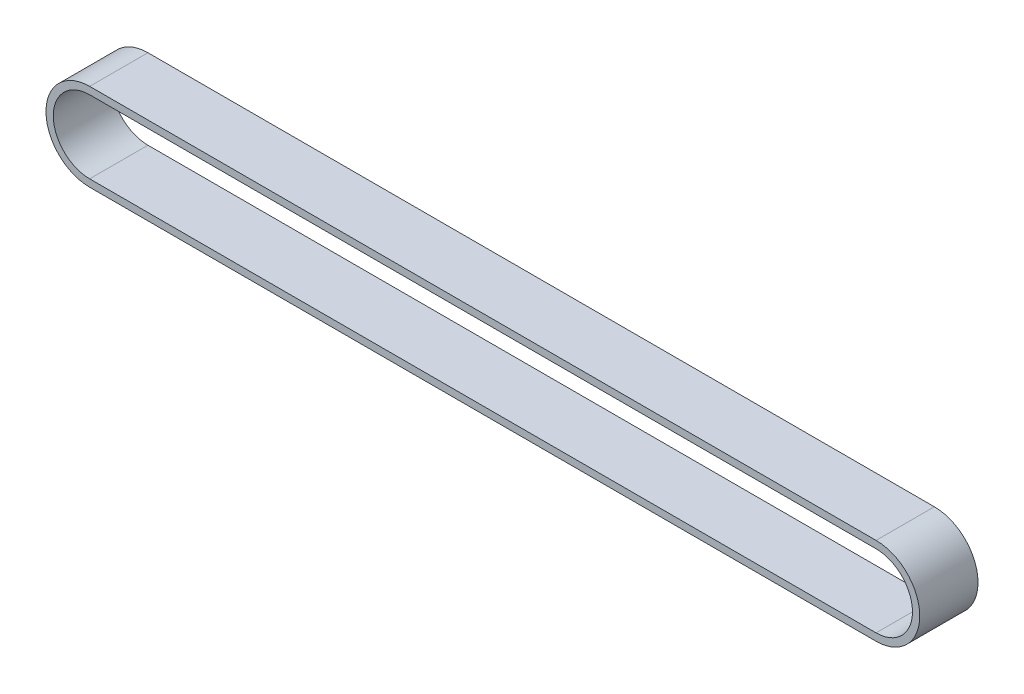
ISO-10303-21;
HEADER;
FILE_DESCRIPTION(('STEP AP214'),'2;1');
FILE_NAME('part.step','',(''),(''),'','','');
FILE_SCHEMA(('AUTOMOTIVE_DESIGN { 1 0 10303 214 1 1 1 1 }'));
ENDSEC;
DATA;
#1=APPLICATION_CONTEXT('core data for automotive mechanical design processes');
#2=APPLICATION_PROTOCOL_DEFINITION('international standard','automotive_design',2000,#1);
#3=PRODUCT_CONTEXT('',#1,'mechanical');
#4=PRODUCT('Part','Part','',(#3));
#5=PRODUCT_RELATED_PRODUCT_CATEGORY('part','',(#4));
#6=PRODUCT_DEFINITION_FORMATION('','',#4);
#7=PRODUCT_DEFINITION_CONTEXT('part definition',#1,'design');
#8=PRODUCT_DEFINITION('design','',#6,#7);
#9=PRODUCT_DEFINITION_SHAPE('','',#8);
#10=(LENGTH_UNIT() NAMED_UNIT(*) SI_UNIT(.MILLI.,.METRE.));
#11=(NAMED_UNIT(*) PLANE_ANGLE_UNIT() SI_UNIT($,.RADIAN.));
#12=(NAMED_UNIT(*) SI_UNIT($,.STERADIAN.) SOLID_ANGLE_UNIT());
#13=UNCERTAINTY_MEASURE_WITH_UNIT(LENGTH_MEASURE(1.E-05),#10,'distance_accuracy_value','');
#14=(GEOMETRIC_REPRESENTATION_CONTEXT(3) GLOBAL_UNCERTAINTY_ASSIGNED_CONTEXT((#13)) GLOBAL_UNIT_ASSIGNED_CONTEXT((#10,
#11,#12)) REPRESENTATION_CONTEXT('',''));
#15=CARTESIAN_POINT('',(0.,0.,0.));
#16=DIRECTION('',(0.,0.,1.));
#17=DIRECTION('',(1.,0.,0.));
#18=AXIS2_PLACEMENT_3D('',#15,#16,#17);
#19=CARTESIAN_POINT('',(-18.8262894297513,0.,8.));
#20=DIRECTION('',(0.,0.,1.));
#21=DIRECTION('',(1.,0.,0.));
#22=AXIS2_PLACEMENT_3D('',#19,#20,#21);
#23=PLANE('',#22);
#24=CARTESIAN_POINT('',(-18.8262894297513,0.,8.));
#25=DIRECTION('',(0.,0.,1.));
#26=DIRECTION('',(1.,0.,0.));
#27=AXIS2_PLACEMENT_3D('',#24,#25,#26);
#28=CIRCLE('',#27,6.);
#29=CARTESIAN_POINT('',(-18.8262894297513,6.,8.));
#30=VERTEX_POINT('',#29);
#31=CARTESIAN_POINT('',(-18.8262894297513,-6.,8.));
#32=VERTEX_POINT('',#31);
#33=EDGE_CURVE('E134',#30,#32,#28,.T.);
#34=ORIENTED_EDGE('',*,*,#33,.T.);
#35=DIRECTION('',(1.,0.,0.));
#36=VECTOR('',#35,1.);
#37=CARTESIAN_POINT('',(-18.8262894297513,-6.,8.));
#38=LINE('',#37,#36);
#39=CARTESIAN_POINT('',(89.1737105702487,-6.,8.));
#40=VERTEX_POINT('',#39);
#41=EDGE_CURVE('E137',#32,#40,#38,.T.);
#42=ORIENTED_EDGE('',*,*,#41,.T.);
#43=CARTESIAN_POINT('',(89.1737105702487,0.,8.));
#44=DIRECTION('',(0.,0.,1.));
#45=DIRECTION('',(1.,0.,0.));
#46=AXIS2_PLACEMENT_3D('',#43,#44,#45);
#47=CIRCLE('',#46,6.);
#48=CARTESIAN_POINT('',(89.1737105702487,6.,8.));
#49=VERTEX_POINT('',#48);
#50=EDGE_CURVE('E140',#40,#49,#47,.T.);
#51=ORIENTED_EDGE('',*,*,#50,.T.);
#52=DIRECTION('',(-1.,0.,0.));
#53=VECTOR('',#52,1.);
#54=CARTESIAN_POINT('',(-18.8262894297513,6.,8.));
#55=LINE('',#54,#53);
#56=EDGE_CURVE('E142',#49,#30,#55,.T.);
#57=ORIENTED_EDGE('',*,*,#56,.T.);
#58=EDGE_LOOP('',(#34,#42,#51,#57));
#59=FACE_BOUND('',#58,.T.);
#60=DIRECTION('',(1.,0.,0.));
#61=VECTOR('',#60,1.);
#62=CARTESIAN_POINT('',(-18.8262894297513,-5.,8.));
#63=LINE('',#62,#61);
#64=CARTESIAN_POINT('',(-18.8262894297513,-5.,8.));
#65=VERTEX_POINT('',#64);
#66=CARTESIAN_POINT('',(89.1737105702487,-5.,8.));
#67=VERTEX_POINT('',#66);
#68=EDGE_CURVE('E106',#65,#67,#63,.T.);
#69=ORIENTED_EDGE('',*,*,#68,.F.);
#70=CARTESIAN_POINT('',(-18.8262894297513,0.,8.));
#71=DIRECTION('',(0.,0.,1.));
#72=DIRECTION('',(1.,0.,0.));
#73=AXIS2_PLACEMENT_3D('',#70,#71,#72);
#74=CIRCLE('',#73,5.);
#75=CARTESIAN_POINT('',(-18.8262894297513,5.,8.));
#76=VERTEX_POINT('',#75);
#77=EDGE_CURVE('E98',#76,#65,#74,.T.);
#78=ORIENTED_EDGE('',*,*,#77,.F.);
#79=DIRECTION('',(-1.,0.,0.));
#80=VECTOR('',#79,1.);
#81=CARTESIAN_POINT('',(-18.8262894297513,5.,8.));
#82=LINE('',#81,#80);
#83=CARTESIAN_POINT('',(89.1737105702487,5.,8.));
#84=VERTEX_POINT('',#83);
#85=EDGE_CURVE('E120',#84,#76,#82,.T.);
#86=ORIENTED_EDGE('',*,*,#85,.F.);
#87=CARTESIAN_POINT('',(89.1737105702487,0.,8.));
#88=DIRECTION('',(0.,0.,1.));
#89=DIRECTION('',(1.,0.,0.));
#90=AXIS2_PLACEMENT_3D('',#87,#88,#89);
#91=CIRCLE('',#90,5.);
#92=EDGE_CURVE('E118',#67,#84,#91,.T.);
#93=ORIENTED_EDGE('',*,*,#92,.F.);
#94=EDGE_LOOP('',(#69,#78,#86,#93));
#95=FACE_BOUND('',#94,.T.);
#96=ADVANCED_FACE('F33',(#59,#95),#23,.T.);
#97=CARTESIAN_POINT('',(-18.8262894297513,0.,0.));
#98=DIRECTION('',(0.,0.,1.));
#99=DIRECTION('',(1.,0.,0.));
#100=AXIS2_PLACEMENT_3D('',#97,#98,#99);
#101=PLANE('',#100);
#102=CARTESIAN_POINT('',(-18.8262894297513,0.,0.));
#103=DIRECTION('',(0.,0.,1.));
#104=DIRECTION('',(1.,0.,0.));
#105=AXIS2_PLACEMENT_3D('',#102,#103,#104);
#106=CIRCLE('',#105,6.);
#107=CARTESIAN_POINT('',(-18.8262894297513,6.,0.));
#108=VERTEX_POINT('',#107);
#109=CARTESIAN_POINT('',(-18.8262894297513,-6.,0.));
#110=VERTEX_POINT('',#109);
#111=EDGE_CURVE('E114',#108,#110,#106,.T.);
#112=ORIENTED_EDGE('',*,*,#111,.F.);
#113=DIRECTION('',(-1.,0.,0.));
#114=VECTOR('',#113,1.);
#115=CARTESIAN_POINT('',(-18.8262894297513,6.,0.));
#116=LINE('',#115,#114);
#117=CARTESIAN_POINT('',(89.1737105702487,6.,0.));
#118=VERTEX_POINT('',#117);
#119=EDGE_CURVE('E138',#118,#108,#116,.T.);
#120=ORIENTED_EDGE('',*,*,#119,.F.);
#121=CARTESIAN_POINT('',(89.1737105702487,0.,0.));
#122=DIRECTION('',(0.,0.,1.));
#123=DIRECTION('',(1.,0.,0.));
#124=AXIS2_PLACEMENT_3D('',#121,#122,#123);
#125=CIRCLE('',#124,6.);
#126=CARTESIAN_POINT('',(89.1737105702487,-6.,0.));
#127=VERTEX_POINT('',#126);
#128=EDGE_CURVE('E149',#127,#118,#125,.T.);
#129=ORIENTED_EDGE('',*,*,#128,.F.);
#130=DIRECTION('',(1.,0.,0.));
#131=VECTOR('',#130,1.);
#132=CARTESIAN_POINT('',(-18.8262894297513,-6.,0.));
#133=LINE('',#132,#131);
#134=EDGE_CURVE('E147',#110,#127,#133,.T.);
#135=ORIENTED_EDGE('',*,*,#134,.F.);
#136=EDGE_LOOP('',(#112,#120,#129,#135));
#137=FACE_BOUND('',#136,.T.);
#138=CARTESIAN_POINT('',(-18.8262894297513,0.,0.));
#139=DIRECTION('',(0.,0.,1.));
#140=DIRECTION('',(1.,0.,0.));
#141=AXIS2_PLACEMENT_3D('',#138,#139,#140);
#142=CIRCLE('',#141,5.);
#143=CARTESIAN_POINT('',(-18.8262894297513,5.,0.));
#144=VERTEX_POINT('',#143);
#145=CARTESIAN_POINT('',(-18.8262894297513,-5.,0.));
#146=VERTEX_POINT('',#145);
#147=EDGE_CURVE('E56',#144,#146,#142,.T.);
#148=ORIENTED_EDGE('',*,*,#147,.T.);
#149=DIRECTION('',(1.,0.,0.));
#150=VECTOR('',#149,1.);
#151=CARTESIAN_POINT('',(-18.8262894297513,-5.,0.));
#152=LINE('',#151,#150);
#153=CARTESIAN_POINT('',(89.1737105702487,-5.,0.));
#154=VERTEX_POINT('',#153);
#155=EDGE_CURVE('E113',#146,#154,#152,.T.);
#156=ORIENTED_EDGE('',*,*,#155,.T.);
#157=CARTESIAN_POINT('',(89.1737105702487,0.,0.));
#158=DIRECTION('',(0.,0.,1.));
#159=DIRECTION('',(1.,0.,0.));
#160=AXIS2_PLACEMENT_3D('',#157,#158,#159);
#161=CIRCLE('',#160,5.);
#162=CARTESIAN_POINT('',(89.1737105702487,5.,0.));
#163=VERTEX_POINT('',#162);
#164=EDGE_CURVE('E126',#154,#163,#161,.T.);
#165=ORIENTED_EDGE('',*,*,#164,.T.);
#166=DIRECTION('',(-1.,0.,0.));
#167=VECTOR('',#166,1.);
#168=CARTESIAN_POINT('',(-18.8262894297513,5.,0.));
#169=LINE('',#168,#167);
#170=EDGE_CURVE('E107',#163,#144,#169,.T.);
#171=ORIENTED_EDGE('',*,*,#170,.T.);
#172=EDGE_LOOP('',(#148,#156,#165,#171));
#173=FACE_BOUND('',#172,.T.);
#174=ADVANCED_FACE('F167',(#137,#173),#101,.F.);
#175=CARTESIAN_POINT('',(-18.8262894297513,0.,8.));
#176=DIRECTION('',(0.,0.,-1.));
#177=DIRECTION('',(-1.,0.,0.));
#178=AXIS2_PLACEMENT_3D('',#175,#176,#177);
#179=CYLINDRICAL_SURFACE('',#178,6.);
#180=ORIENTED_EDGE('',*,*,#111,.T.);
#181=DIRECTION('',(0.,0.,-1.));
#182=VECTOR('',#181,1.);
#183=CARTESIAN_POINT('',(-18.8262894297513,-6.,8.));
#184=LINE('',#183,#182);
#185=EDGE_CURVE('E11',#32,#110,#184,.T.);
#186=ORIENTED_EDGE('',*,*,#185,.F.);
#187=ORIENTED_EDGE('',*,*,#33,.F.);
#188=DIRECTION('',(0.,0.,-1.));
#189=VECTOR('',#188,1.);
#190=CARTESIAN_POINT('',(-18.8262894297513,6.,8.));
#191=LINE('',#190,#189);
#192=EDGE_CURVE('E144',#30,#108,#191,.T.);
#193=ORIENTED_EDGE('',*,*,#192,.T.);
#194=EDGE_LOOP('',(#180,#186,#187,#193));
#195=FACE_BOUND('',#194,.T.);
#196=ADVANCED_FACE('F35',(#195),#179,.T.);
#197=CARTESIAN_POINT('',(-18.8262894297513,-6.,8.));
#198=DIRECTION('',(0.,1.,0.));
#199=DIRECTION('',(0.,0.,1.));
#200=AXIS2_PLACEMENT_3D('',#197,#198,#199);
#201=PLANE('',#200);
#202=ORIENTED_EDGE('',*,*,#134,.T.);
#203=DIRECTION('',(0.,0.,-1.));
#204=VECTOR('',#203,1.);
#205=CARTESIAN_POINT('',(89.1737105702487,-6.,8.));
#206=LINE('',#205,#204);
#207=EDGE_CURVE('E41',#40,#127,#206,.T.);
#208=ORIENTED_EDGE('',*,*,#207,.F.);
#209=ORIENTED_EDGE('',*,*,#41,.F.);
#210=ORIENTED_EDGE('',*,*,#185,.T.);
#211=EDGE_LOOP('',(#202,#208,#209,#210));
#212=FACE_BOUND('',#211,.T.);
#213=ADVANCED_FACE('F177',(#212),#201,.F.);
#214=CARTESIAN_POINT('',(89.1737105702487,0.,8.));
#215=DIRECTION('',(0.,0.,-1.));
#216=DIRECTION('',(-1.,0.,0.));
#217=AXIS2_PLACEMENT_3D('',#214,#215,#216);
#218=CYLINDRICAL_SURFACE('',#217,6.);
#219=ORIENTED_EDGE('',*,*,#128,.T.);
#220=DIRECTION('',(0.,0.,-1.));
#221=VECTOR('',#220,1.);
#222=CARTESIAN_POINT('',(89.1737105702487,6.,8.));
#223=LINE('',#222,#221);
#224=EDGE_CURVE('E154',#49,#118,#223,.T.);
#225=ORIENTED_EDGE('',*,*,#224,.F.);
#226=ORIENTED_EDGE('',*,*,#50,.F.);
#227=ORIENTED_EDGE('',*,*,#207,.T.);
#228=EDGE_LOOP('',(#219,#225,#226,#227));
#229=FACE_BOUND('',#228,.T.);
#230=ADVANCED_FACE('F161',(#229),#218,.T.);
#231=CARTESIAN_POINT('',(-18.8262894297513,6.,8.));
#232=DIRECTION('',(0.,-1.,0.));
#233=DIRECTION('',(0.,0.,-1.));
#234=AXIS2_PLACEMENT_3D('',#231,#232,#233);
#235=PLANE('',#234);
#236=ORIENTED_EDGE('',*,*,#119,.T.);
#237=ORIENTED_EDGE('',*,*,#192,.F.);
#238=ORIENTED_EDGE('',*,*,#56,.F.);
#239=ORIENTED_EDGE('',*,*,#224,.T.);
#240=EDGE_LOOP('',(#236,#237,#238,#239));
#241=FACE_BOUND('',#240,.T.);
#242=ADVANCED_FACE('F171',(#241),#235,.F.);
#243=CARTESIAN_POINT('',(-18.8262894297513,0.,8.));
#244=DIRECTION('',(0.,0.,-1.));
#245=DIRECTION('',(-1.,0.,0.));
#246=AXIS2_PLACEMENT_3D('',#243,#244,#245);
#247=CYLINDRICAL_SURFACE('',#246,5.);
#248=ORIENTED_EDGE('',*,*,#147,.F.);
#249=DIRECTION('',(0.,0.,-1.));
#250=VECTOR('',#249,1.);
#251=CARTESIAN_POINT('',(-18.8262894297513,5.,8.));
#252=LINE('',#251,#250);
#253=EDGE_CURVE('E102',#76,#144,#252,.T.);
#254=ORIENTED_EDGE('',*,*,#253,.F.);
#255=ORIENTED_EDGE('',*,*,#77,.T.);
#256=DIRECTION('',(0.,0.,-1.));
#257=VECTOR('',#256,1.);
#258=CARTESIAN_POINT('',(-18.8262894297513,-5.,8.));
#259=LINE('',#258,#257);
#260=EDGE_CURVE('E101',#65,#146,#259,.T.);
#261=ORIENTED_EDGE('',*,*,#260,.T.);
#262=EDGE_LOOP('',(#248,#254,#255,#261));
#263=FACE_BOUND('',#262,.T.);
#264=ADVANCED_FACE('F100',(#263),#247,.F.);
#265=CARTESIAN_POINT('',(-18.8262894297513,-5.,8.));
#266=DIRECTION('',(0.,1.,0.));
#267=DIRECTION('',(0.,0.,1.));
#268=AXIS2_PLACEMENT_3D('',#265,#266,#267);
#269=PLANE('',#268);
#270=ORIENTED_EDGE('',*,*,#155,.F.);
#271=ORIENTED_EDGE('',*,*,#260,.F.);
#272=ORIENTED_EDGE('',*,*,#68,.T.);
#273=DIRECTION('',(0.,0.,-1.));
#274=VECTOR('',#273,1.);
#275=CARTESIAN_POINT('',(89.1737105702487,-5.,8.));
#276=LINE('',#275,#274);
#277=EDGE_CURVE('E115',#67,#154,#276,.T.);
#278=ORIENTED_EDGE('',*,*,#277,.T.);
#279=EDGE_LOOP('',(#270,#271,#272,#278));
#280=FACE_BOUND('',#279,.T.);
#281=ADVANCED_FACE('F110',(#280),#269,.T.);
#282=CARTESIAN_POINT('',(89.1737105702487,0.,8.));
#283=DIRECTION('',(0.,0.,-1.));
#284=DIRECTION('',(-1.,0.,0.));
#285=AXIS2_PLACEMENT_3D('',#282,#283,#284);
#286=CYLINDRICAL_SURFACE('',#285,5.);
#287=ORIENTED_EDGE('',*,*,#164,.F.);
#288=ORIENTED_EDGE('',*,*,#277,.F.);
#289=ORIENTED_EDGE('',*,*,#92,.T.);
#290=DIRECTION('',(0.,0.,-1.));
#291=VECTOR('',#290,1.);
#292=CARTESIAN_POINT('',(89.1737105702487,5.,8.));
#293=LINE('',#292,#291);
#294=EDGE_CURVE('E48',#84,#163,#293,.T.);
#295=ORIENTED_EDGE('',*,*,#294,.T.);
#296=EDGE_LOOP('',(#287,#288,#289,#295));
#297=FACE_BOUND('',#296,.T.);
#298=ADVANCED_FACE('F200',(#297),#286,.F.);
#299=CARTESIAN_POINT('',(-18.8262894297513,5.,8.));
#300=DIRECTION('',(0.,-1.,0.));
#301=DIRECTION('',(0.,0.,-1.));
#302=AXIS2_PLACEMENT_3D('',#299,#300,#301);
#303=PLANE('',#302);
#304=ORIENTED_EDGE('',*,*,#170,.F.);
#305=ORIENTED_EDGE('',*,*,#294,.F.);
#306=ORIENTED_EDGE('',*,*,#85,.T.);
#307=ORIENTED_EDGE('',*,*,#253,.T.);
#308=EDGE_LOOP('',(#304,#305,#306,#307));
#309=FACE_BOUND('',#308,.T.);
#310=ADVANCED_FACE('F204',(#309),#303,.T.);
#311=CLOSED_SHELL('',(#96,#174,#196,#213,#230,#242,#264,#281,#298,#310));
#312=MANIFOLD_SOLID_BREP('B2',#311);
#313=ADVANCED_BREP_SHAPE_REPRESENTATION('',(#18,#312),#14);
#314=SHAPE_DEFINITION_REPRESENTATION(#9,#313);
ENDSEC;
END-ISO-10303-21;
